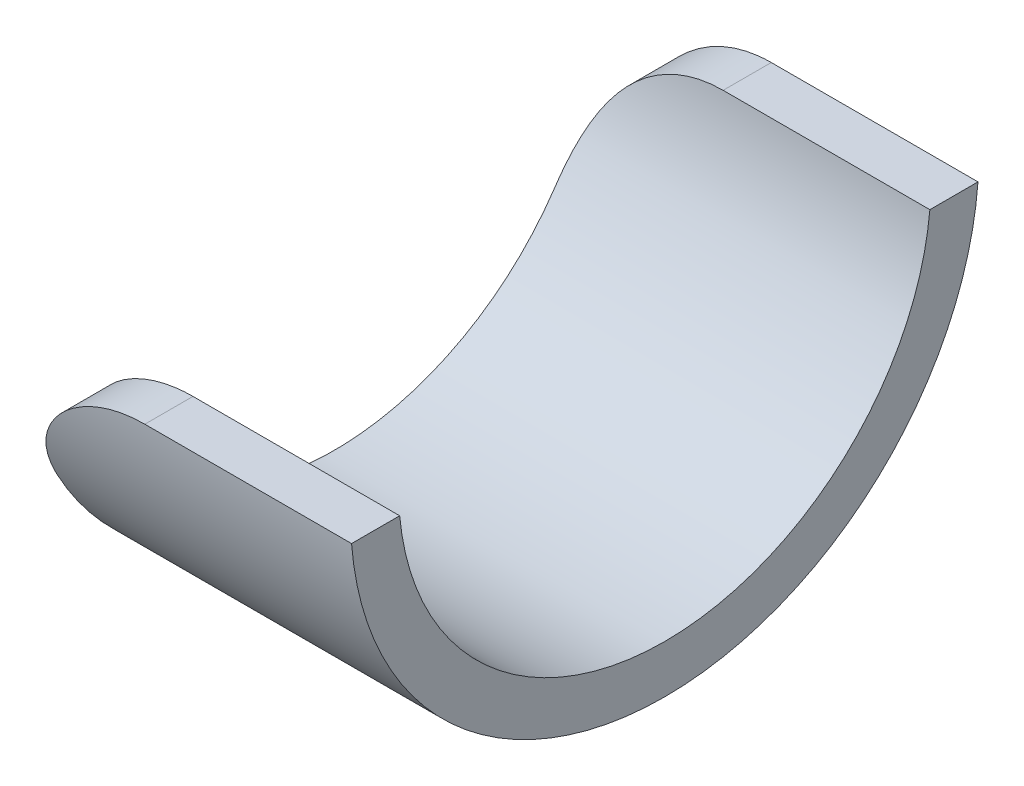
ISO-10303-21;
HEADER;
FILE_DESCRIPTION(('STEP AP214'),'2;1');
FILE_NAME('part.step','',(''),(''),'','','');
FILE_SCHEMA(('AUTOMOTIVE_DESIGN { 1 0 10303 214 1 1 1 1 }'));
ENDSEC;
DATA;
#1=APPLICATION_CONTEXT('core data for automotive mechanical design processes');
#2=APPLICATION_PROTOCOL_DEFINITION('international standard','automotive_design',2000,#1);
#3=PRODUCT_CONTEXT('',#1,'mechanical');
#4=PRODUCT('Part','Part','',(#3));
#5=PRODUCT_RELATED_PRODUCT_CATEGORY('part','',(#4));
#6=PRODUCT_DEFINITION_FORMATION('','',#4);
#7=PRODUCT_DEFINITION_CONTEXT('part definition',#1,'design');
#8=PRODUCT_DEFINITION('design','',#6,#7);
#9=PRODUCT_DEFINITION_SHAPE('','',#8);
#10=(LENGTH_UNIT() NAMED_UNIT(*) SI_UNIT(.MILLI.,.METRE.));
#11=(NAMED_UNIT(*) PLANE_ANGLE_UNIT() SI_UNIT($,.RADIAN.));
#12=(NAMED_UNIT(*) SI_UNIT($,.STERADIAN.) SOLID_ANGLE_UNIT());
#13=UNCERTAINTY_MEASURE_WITH_UNIT(LENGTH_MEASURE(1.E-05),#10,'distance_accuracy_value','');
#14=(GEOMETRIC_REPRESENTATION_CONTEXT(3) GLOBAL_UNCERTAINTY_ASSIGNED_CONTEXT((#13)) GLOBAL_UNIT_ASSIGNED_CONTEXT((#10,
#11,#12)) REPRESENTATION_CONTEXT('',''));
#15=CARTESIAN_POINT('',(0.,0.,0.));
#16=DIRECTION('',(0.,0.,1.));
#17=DIRECTION('',(1.,0.,0.));
#18=AXIS2_PLACEMENT_3D('',#15,#16,#17);
#19=CARTESIAN_POINT('',(25.4,0.,0.));
#20=DIRECTION('',(-1.,0.,0.));
#21=DIRECTION('',(0.,0.,1.));
#22=AXIS2_PLACEMENT_3D('',#19,#20,#21);
#23=CYLINDRICAL_SURFACE('',#22,24.13);
#24=CARTESIAN_POINT('',(0.,0.,0.));
#25=DIRECTION('',(1.,0.,0.));
#26=DIRECTION('',(0.,0.,-1.));
#27=AXIS2_PLACEMENT_3D('',#24,#25,#26);
#28=CIRCLE('',#27,24.13);
#29=CARTESIAN_POINT('',(0.,-11.43,21.2511646739655));
#30=VERTEX_POINT('',#29);
#31=CARTESIAN_POINT('',(0.,-11.43,-21.2511646739655));
#32=VERTEX_POINT('',#31);
#33=EDGE_CURVE('E168',#30,#32,#28,.T.);
#34=ORIENTED_EDGE('',*,*,#33,.T.);
#35=CARTESIAN_POINT('',(0.,-11.43,-21.2511646739655));
#36=CARTESIAN_POINT('',(-2.62243007126413E-05,-11.1860224640543,-21.3824335393108));
#37=CARTESIAN_POINT('',(0.00937477308694025,-10.9396845502003,-21.5094658719944));
#38=CARTESIAN_POINT('',(0.0479236395877504,-10.4439055163118,-21.7544876609394));
#39=CARTESIAN_POINT('',(0.0770830725086785,-10.1944626630503,-21.8724717766096));
#40=CARTESIAN_POINT('',(0.156118837118842,-9.69390311880306,-22.0988883031836));
#41=CARTESIAN_POINT('',(0.206034677985443,-9.44278413916173,-22.2073020174487));
#42=CARTESIAN_POINT('',(0.327202368802155,-8.94150477192952,-22.4138311063666));
#43=CARTESIAN_POINT('',(0.398449861662112,-8.69134419913753,-22.5119485785534));
#44=CARTESIAN_POINT('',(0.562964102877934,-8.19324315777415,-22.6979873973509));
#45=CARTESIAN_POINT('',(0.656316560719896,-7.94531533145705,-22.7858670176028));
#46=CARTESIAN_POINT('',(0.864917743170024,-7.45513554205446,-22.9509202864259));
#47=CARTESIAN_POINT('',(0.980168085088761,-7.21288399968737,-23.0280931434996));
#48=CARTESIAN_POINT('',(1.23201910546764,-6.73697795539725,-23.1717872843801));
#49=CARTESIAN_POINT('',(1.36858542185224,-6.50331035205277,-23.238325368346));
#50=CARTESIAN_POINT('',(1.66250238886438,-6.04664831564512,-23.3613112980713));
#51=CARTESIAN_POINT('',(1.81985155894157,-5.82365312382992,-23.4177598619249));
#52=CARTESIAN_POINT('',(2.14347109553134,-5.40470991060296,-23.5178520749754));
#53=CARTESIAN_POINT('',(2.3085037041298,-5.20794553211169,-23.562088255933));
#54=CARTESIAN_POINT('',(2.65479050631666,-4.82757709066209,-23.6429526368408));
#55=CARTESIAN_POINT('',(2.83604409448118,-4.64397253699317,-23.6795811205675));
#56=CARTESIAN_POINT('',(3.21363852043108,-4.29143598197451,-23.7460034791518));
#57=CARTESIAN_POINT('',(3.40998739998141,-4.12251190492314,-23.7757936768714));
#58=CARTESIAN_POINT('',(3.81630838261891,-3.80087139049984,-23.8293278664702));
#59=CARTESIAN_POINT('',(4.02628051460483,-3.64815498751076,-23.8530718455232));
#60=CARTESIAN_POINT('',(4.45704285565434,-3.36104542848596,-23.895213047223));
#61=CARTESIAN_POINT('',(4.67775947309696,-3.22654644377813,-23.9136419215247));
#62=CARTESIAN_POINT('',(5.12964311440567,-2.97581587645182,-23.9461355713094));
#63=CARTESIAN_POINT('',(5.36081023917931,-2.85958447026916,-23.960200304643));
#64=CARTESIAN_POINT('',(5.831928095831,-2.64628232956131,-23.9846954693647));
#65=CARTESIAN_POINT('',(6.07187653555342,-2.54920663658397,-23.9951268417838));
#66=CARTESIAN_POINT('',(6.55895637291033,-2.37488541721316,-24.0130070257699));
#67=CARTESIAN_POINT('',(6.80608684064031,-2.29763733623003,-24.0204562216298));
#68=CARTESIAN_POINT('',(7.25703859547032,-2.17660389124137,-24.0316919659944));
#69=CARTESIAN_POINT('',(7.45989511606065,-2.12922984902613,-24.0359096588211));
#70=CARTESIAN_POINT('',(7.86827969905803,-2.04787644322711,-24.0429774229925));
#71=CARTESIAN_POINT('',(8.07380739515986,-2.0138952626542,-24.0458276798666));
#72=CARTESIAN_POINT('',(8.48648285909893,-1.95949981658252,-24.0503232209338));
#73=CARTESIAN_POINT('',(8.69362909932989,-1.93907402968682,-24.0519695285443));
#74=CARTESIAN_POINT('',(9.10884950593469,-1.9118178800914,-24.0541447550348));
#75=CARTESIAN_POINT('',(9.31692380045259,-1.90498945704754,-24.0546735144979));
#76=CARTESIAN_POINT('',(9.525,-1.905,-24.0546850945923));
#77=B_SPLINE_CURVE_WITH_KNOTS('',3,(#35,#36,#37,#38,#39,#40,#41,#42,#43,#44,#45,#46,#47,#48,#49,
#50,#51,#52,#53,#54,#55,#56,#57,#58,#59,#60,#61,#62,#63,#64,#65,#66,#67,#68,#69,#70,#71,#72,#73,
#74,#75,#76),.UNSPECIFIED.,.F.,.F.,(4,2,2,2,2,2,2,2,2,2,2,2,2,2,2,2,2,2,2,2,4),(0.,
0.831053790770307,1.66259438406464,2.49572508742816,3.32868573588827,4.16493056434458,
5.0012371793046,5.83620930417523,6.67112197849129,7.45196225401338,8.23277339798149,
9.01400342752858,9.79523511433871,10.5717136526312,11.3481996900133,12.1244844697337,
12.9006691826562,13.5253091224103,14.1498642890198,14.7738879332271,15.3980005876607),.UNSPECIFIED.);
#78=CARTESIAN_POINT('',(9.525,-1.905,-24.0546850945923));
#79=VERTEX_POINT('',#78);
#80=EDGE_CURVE('E46',#32,#79,#77,.T.);
#81=ORIENTED_EDGE('',*,*,#80,.T.);
#82=DIRECTION('',(-1.,0.,0.));
#83=VECTOR('',#82,1.);
#84=CARTESIAN_POINT('',(25.4,-1.905,-24.0546850945923));
#85=LINE('',#84,#83);
#86=CARTESIAN_POINT('',(25.4,-1.905,-24.0546850945923));
#87=VERTEX_POINT('',#86);
#88=EDGE_CURVE('E98',#87,#79,#85,.T.);
#89=ORIENTED_EDGE('',*,*,#88,.F.);
#90=CARTESIAN_POINT('',(25.4,0.,0.));
#91=DIRECTION('',(1.,0.,0.));
#92=DIRECTION('',(0.,0.,-1.));
#93=AXIS2_PLACEMENT_3D('',#90,#91,#92);
#94=CIRCLE('',#93,24.13);
#95=CARTESIAN_POINT('',(25.4,-1.905,24.0546850945923));
#96=VERTEX_POINT('',#95);
#97=EDGE_CURVE('E105',#96,#87,#94,.T.);
#98=ORIENTED_EDGE('',*,*,#97,.F.);
#99=DIRECTION('',(-1.,0.,0.));
#100=VECTOR('',#99,1.);
#101=CARTESIAN_POINT('',(25.4,-1.905,24.0546850945923));
#102=LINE('',#101,#100);
#103=CARTESIAN_POINT('',(9.525,-1.905,24.0546850945923));
#104=VERTEX_POINT('',#103);
#105=EDGE_CURVE('E187',#96,#104,#102,.T.);
#106=ORIENTED_EDGE('',*,*,#105,.T.);
#107=CARTESIAN_POINT('',(9.525,-1.905,24.0546850945923));
#108=CARTESIAN_POINT('',(9.25902855860662,-1.90497112249098,24.0546543706783));
#109=CARTESIAN_POINT('',(8.99305996792605,-1.91613908815105,24.0538018907344));
#110=CARTESIAN_POINT('',(8.46300387273561,-1.9606612994031,24.0502314004206));
#111=CARTESIAN_POINT('',(8.1989163303127,-1.99401509654734,24.0475134277582));
#112=CARTESIAN_POINT('',(7.67456650786336,-2.08268810274374,24.0399910936523));
#113=CARTESIAN_POINT('',(7.41430308962371,-2.1380006327919,24.0351873665735));
#114=CARTESIAN_POINT('',(6.89937138401652,-2.2701777631287,24.0230644040504));
#115=CARTESIAN_POINT('',(6.6447029998715,-2.34704199031998,24.0157452121526));
#116=CARTESIAN_POINT('',(6.14260206552165,-2.52181707329971,23.9980216823762));
#117=CARTESIAN_POINT('',(5.89517469334633,-2.61974259140439,23.9876151932781));
#118=CARTESIAN_POINT('',(5.40953230749561,-2.83586324053376,23.9630257307452));
#119=CARTESIAN_POINT('',(5.17131717562001,-2.9540581113811,23.9488428057835));
#120=CARTESIAN_POINT('',(4.70588661033124,-3.20976539159897,23.9159133288637));
#121=CARTESIAN_POINT('',(4.47866874681592,-3.34727350681213,23.8971677906916));
#122=CARTESIAN_POINT('',(4.03685190596719,-3.64051036300694,23.8542560267361));
#123=CARTESIAN_POINT('',(3.82225273297257,-3.79623882135804,23.8300898850306));
#124=CARTESIAN_POINT('',(3.40913310360506,-4.12311644738061,23.7757019327644));
#125=CARTESIAN_POINT('',(3.21048485846543,-4.29411352349554,23.7455368268045));
#126=CARTESIAN_POINT('',(2.82856447170116,-4.65123007876344,23.6781748356056));
#127=CARTESIAN_POINT('',(2.64529225956836,-4.8373494885639,23.6409779826139));
#128=CARTESIAN_POINT('',(2.29548581756171,-5.22294907941939,23.5587888909164));
#129=CARTESIAN_POINT('',(2.12894399446347,-5.42242313023072,23.5138002140805));
#130=CARTESIAN_POINT('',(1.81359856584554,-5.83295582002549,23.4153383321293));
#131=CARTESIAN_POINT('',(1.6647945124326,-6.04401416629933,23.3618653413296));
#132=CARTESIAN_POINT('',(1.38874855215797,-6.47113711214399,23.2471317644862));
#133=CARTESIAN_POINT('',(1.26111596507832,-6.68700031712436,23.1860605993367));
#134=CARTESIAN_POINT('',(1.02423098390503,-7.12596104699,23.0549352631465));
#135=CARTESIAN_POINT('',(0.914978750332491,-7.34905863503499,22.9848810136632));
#136=CARTESIAN_POINT('',(0.715071957252479,-7.80069709441672,22.8355565811858));
#137=CARTESIAN_POINT('',(0.624434549431874,-8.02924277118396,22.7562780033086));
#138=CARTESIAN_POINT('',(0.461930113313286,-8.48959759740636,22.5885730040502));
#139=CARTESIAN_POINT('',(0.390061506300686,-8.72140647065202,22.5001473529379));
#140=CARTESIAN_POINT('',(0.271603413772416,-9.16141574281794,22.3243212812767));
#141=CARTESIAN_POINT('',(0.223127464472969,-9.36947657204716,22.2378315842086));
#142=CARTESIAN_POINT('',(0.140643449883782,-9.7854805725289,22.0579381550127));
#143=CARTESIAN_POINT('',(0.106635777848727,-9.99342374042991,21.9645342350342));
#144=CARTESIAN_POINT('',(0.0527401220690146,-10.4075477143405,21.771354509249));
#145=CARTESIAN_POINT('',(0.0328187663108996,-10.6137315346706,21.6715943779708));
#146=CARTESIAN_POINT('',(0.00644491721495352,-11.0238100019182,21.4659113001518));
#147=CARTESIAN_POINT('',(-1.12453408408947E-05,-11.2277052573949,21.3599900405856));
#148=CARTESIAN_POINT('',(0.,-11.43,21.2511646739655));
#149=B_SPLINE_CURVE_WITH_KNOTS('',3,(#107,#108,#109,#110,#111,#112,#113,#114,#115,#116,#117,
#118,#119,#120,#121,#122,#123,#124,#125,#126,#127,#128,#129,#130,#131,#132,#133,#134,#135,#136,
#137,#138,#139,#140,#141,#142,#143,#144,#145,#146,#147,#148),.UNSPECIFIED.,.F.,.F.,(4,2,2,2,2,2,
2,2,2,2,2,2,2,2,2,2,2,2,2,2,4),(0.,0.797674807200183,1.59533349129078,2.39274974387176,
3.19015219264293,3.98811157936095,4.78606072424157,5.58383273105668,6.38159236462163,
7.17214191497642,7.96268783999794,8.75287333268876,9.54303886831846,10.316430031771,
11.0898279491281,11.8639353089751,12.6379775347455,13.3288503903548,14.0197420230188,
14.7089913240004,15.3980527824104),.UNSPECIFIED.);
#150=EDGE_CURVE('E53',#104,#30,#149,.T.);
#151=ORIENTED_EDGE('',*,*,#150,.T.);
#152=EDGE_LOOP('',(#34,#81,#89,#98,#106,#151));
#153=FACE_BOUND('',#152,.T.);
#154=ADVANCED_FACE('F37',(#153),#23,.T.);
#155=CARTESIAN_POINT('',(25.4,-1.905,-20.3580643480661));
#156=DIRECTION('',(0.,-1.,0.));
#157=DIRECTION('',(0.,0.,-1.));
#158=AXIS2_PLACEMENT_3D('',#155,#156,#157);
#159=PLANE('',#158);
#160=ORIENTED_EDGE('',*,*,#88,.T.);
#161=DIRECTION('',(0.,0.,1.));
#162=VECTOR('',#161,1.);
#163=CARTESIAN_POINT('',(9.525,-1.905,-20.3580643480661));
#164=LINE('',#163,#162);
#165=CARTESIAN_POINT('',(9.525,-1.905,-20.3580643480661));
#166=VERTEX_POINT('',#165);
#167=EDGE_CURVE('E117',#79,#166,#164,.T.);
#168=ORIENTED_EDGE('',*,*,#167,.T.);
#169=DIRECTION('',(-1.,0.,0.));
#170=VECTOR('',#169,1.);
#171=CARTESIAN_POINT('',(25.4,-1.905,-20.3580643480661));
#172=LINE('',#171,#170);
#173=CARTESIAN_POINT('',(25.4,-1.905,-20.3580643480661));
#174=VERTEX_POINT('',#173);
#175=EDGE_CURVE('E101',#174,#166,#172,.T.);
#176=ORIENTED_EDGE('',*,*,#175,.F.);
#177=DIRECTION('',(0.,0.,1.));
#178=VECTOR('',#177,1.);
#179=CARTESIAN_POINT('',(25.4,-1.905,-20.3580643480661));
#180=LINE('',#179,#178);
#181=EDGE_CURVE('E93',#87,#174,#180,.T.);
#182=ORIENTED_EDGE('',*,*,#181,.F.);
#183=EDGE_LOOP('',(#160,#168,#176,#182));
#184=FACE_BOUND('',#183,.T.);
#185=ADVANCED_FACE('F95',(#184),#159,.F.);
#186=CARTESIAN_POINT('',(25.4,0.,0.));
#187=DIRECTION('',(-1.,0.,0.));
#188=DIRECTION('',(0.,0.,1.));
#189=AXIS2_PLACEMENT_3D('',#186,#187,#188);
#190=CYLINDRICAL_SURFACE('',#189,20.447);
#191=ORIENTED_EDGE('',*,*,#175,.T.);
#192=CARTESIAN_POINT('',(9.525,-1.905,-20.3580643480661));
#193=CARTESIAN_POINT('',(9.25978977014526,-1.90497110377044,-20.3580283743182));
#194=CARTESIAN_POINT('',(8.99458190205295,-1.91607541741178,-20.3570267347558));
#195=CARTESIAN_POINT('',(8.46603330595991,-1.96034336128463,-20.352832188804));
#196=CARTESIAN_POINT('',(8.20269256023756,-1.99350678186011,-20.3496393032408));
#197=CARTESIAN_POINT('',(7.67976710818044,-2.08168051639916,-20.3408028731761));
#198=CARTESIAN_POINT('',(7.42018195184562,-2.13668819010333,-20.3351596248361));
#199=CARTESIAN_POINT('',(6.9065823565463,-2.26813517562933,-20.3209194671558));
#200=CARTESIAN_POINT('',(6.65256781040154,-2.34457407471702,-20.312322614697));
#201=CARTESIAN_POINT('',(6.15172905872527,-2.51837915517059,-20.2915062917797));
#202=CARTESIAN_POINT('',(5.90491062304745,-2.61576163208616,-20.2792839976529));
#203=CARTESIAN_POINT('',(5.42046974204375,-2.83065885374987,-20.2504056126832));
#204=CARTESIAN_POINT('',(5.18284713201861,-2.94817323772638,-20.2337496012912));
#205=CARTESIAN_POINT('',(4.71860313323052,-3.20235227155138,-20.1950801117434));
#206=CARTESIAN_POINT('',(4.49197903223694,-3.33901216747872,-20.1730679625452));
#207=CARTESIAN_POINT('',(4.05136405145136,-3.63034088398203,-20.1226806227278));
#208=CARTESIAN_POINT('',(3.83737292244127,-3.78500934911329,-20.0943055576867));
#209=CARTESIAN_POINT('',(3.42620891630364,-4.10893379759801,-20.030560824482));
#210=CARTESIAN_POINT('',(3.22885954487623,-4.27798374878302,-19.9952828225731));
#211=CARTESIAN_POINT('',(2.84947281277147,-4.63073177356297,-19.9165452957226));
#212=CARTESIAN_POINT('',(2.66743532964771,-4.81442972999756,-19.8730858362156));
#213=CARTESIAN_POINT('',(2.32005992918782,-5.19456017598146,-19.7771267369428));
#214=CARTESIAN_POINT('',(2.15471065709082,-5.39098385541035,-19.724633310632));
#215=CARTESIAN_POINT('',(1.84162833815016,-5.79469430757571,-19.6098279166227));
#216=CARTESIAN_POINT('',(1.69389475833076,-6.00198075137795,-19.5475162461149));
#217=CARTESIAN_POINT('',(1.42089667288137,-6.41906899364777,-19.4144755131979));
#218=CARTESIAN_POINT('',(1.29510049382968,-6.62861897179975,-19.3440467118341));
#219=CARTESIAN_POINT('',(1.06130049022161,-7.05389488573657,-19.1930529525103));
#220=CARTESIAN_POINT('',(0.953296570547871,-7.26962078849771,-19.112488048742));
#221=CARTESIAN_POINT('',(0.755103699314461,-7.70549373801177,-18.9409635820805));
#222=CARTESIAN_POINT('',(0.664940401084745,-7.92564665685008,-18.8499893436497));
#223=CARTESIAN_POINT('',(0.50249570259122,-8.36804475355946,-18.6578079286869));
#224=CARTESIAN_POINT('',(0.430213517538051,-8.59028983916225,-18.5566012015262));
#225=CARTESIAN_POINT('',(0.303153739250019,-9.03487826701944,-18.3442481822495));
#226=CARTESIAN_POINT('',(0.248367946006984,-9.25722151419619,-18.23310657765));
#227=CARTESIAN_POINT('',(0.155607328845854,-9.70043791104361,-18.0012194838147));
#228=CARTESIAN_POINT('',(0.117635672778708,-9.92131077597413,-17.8804721898794));
#229=CARTESIAN_POINT('',(0.057778548534097,-10.3594428106769,-17.6302342348168));
#230=CARTESIAN_POINT('',(0.0358505781251143,-10.5767100272518,-17.5007676745597));
#231=CARTESIAN_POINT('',(0.00695864841239081,-11.0068892110165,-17.2334730625406));
#232=CARTESIAN_POINT('',(-1.40946185446643E-05,-11.2198036619075,-17.0956499678064));
#233=CARTESIAN_POINT('',(0.,-11.43,-16.9539054202859));
#234=B_SPLINE_CURVE_WITH_KNOTS('',3,(#192,#193,#194,#195,#196,#197,#198,#199,#200,#201,#202,
#203,#204,#205,#206,#207,#208,#209,#210,#211,#212,#213,#214,#215,#216,#217,#218,#219,#220,#221,
#222,#223,#224,#225,#226,#227,#228,#229,#230,#231,#232,#233),.UNSPECIFIED.,.F.,.F.,(4,2,2,2,2,2,
2,2,2,2,2,2,2,2,2,2,2,2,2,2,4),(0.,0.795393423654686,1.59077928777243,2.38606904486716,
3.18134348689319,3.97723896055609,4.77312017295292,5.5688041133931,6.3644723516572,
7.15021538340832,7.93595213111672,8.72115060258975,9.5063253112738,10.2684854549721,
11.0306415240326,11.7938856708571,12.5570963134924,13.319948736603,14.082944823085,
14.8439122217054,15.604432555074),.UNSPECIFIED.);
#235=CARTESIAN_POINT('',(0.,-11.43,-16.9539054202859));
#236=VERTEX_POINT('',#235);
#237=EDGE_CURVE('E131',#166,#236,#234,.T.);
#238=ORIENTED_EDGE('',*,*,#237,.T.);
#239=CARTESIAN_POINT('',(0.,0.,0.));
#240=DIRECTION('',(-1.,0.,0.));
#241=DIRECTION('',(0.,0.,-1.));
#242=AXIS2_PLACEMENT_3D('',#239,#240,#241);
#243=CIRCLE('',#242,20.447);
#244=CARTESIAN_POINT('',(0.,-11.43,16.9539054202859));
#245=VERTEX_POINT('',#244);
#246=EDGE_CURVE('E114',#236,#245,#243,.T.);
#247=ORIENTED_EDGE('',*,*,#246,.T.);
#248=CARTESIAN_POINT('',(0.,-11.43,16.9539054202859));
#249=CARTESIAN_POINT('',(-2.26556267190623E-05,-11.1970109347333,17.1110348965797));
#250=CARTESIAN_POINT('',(0.00854996527283876,-10.9606584924522,17.2633409521735));
#251=CARTESIAN_POINT('',(0.0441943253259937,-10.4827345096676,17.557631634213));
#252=CARTESIAN_POINT('',(0.0712805745076498,-10.241159019522,17.6996080681937));
#253=CARTESIAN_POINT('',(0.145377805371788,-9.75392492005596,17.9727321356884));
#254=CARTESIAN_POINT('',(0.192449364536353,-9.50825609668595,18.1038453856936));
#255=CARTESIAN_POINT('',(0.307566450309029,-9.01577956315671,18.3540664977231));
#256=CARTESIAN_POINT('',(0.375606449191654,-8.76897217001962,18.4731775128226));
#257=CARTESIAN_POINT('',(0.53383245903843,-8.27531248509759,18.6995490297245));
#258=CARTESIAN_POINT('',(0.624131647136172,-8.02846661678016,18.8067447749873));
#259=CARTESIAN_POINT('',(0.827078092665168,-7.53872313086899,19.0083559040058));
#260=CARTESIAN_POINT('',(0.939727382262767,-7.29582587447428,19.1027701242966));
#261=CARTESIAN_POINT('',(1.18702756275254,-6.81738744881128,19.2786895398164));
#262=CARTESIAN_POINT('',(1.32162936657595,-6.58183123312698,19.3602227547461));
#263=CARTESIAN_POINT('',(1.61248686004771,-6.12037421258529,19.5110161349573));
#264=CARTESIAN_POINT('',(1.76874040418349,-5.89447245394763,19.580277514731));
#265=CARTESIAN_POINT('',(2.08719310004087,-5.47451213954638,19.7015990829017));
#266=CARTESIAN_POINT('',(2.24764088450731,-5.27940511020473,19.7546393047696));
#267=CARTESIAN_POINT('',(2.58476100175011,-4.90138340496377,19.8518094278578));
#268=CARTESIAN_POINT('',(2.76143244282964,-4.71846805992848,19.8959398183609));
#269=CARTESIAN_POINT('',(3.12994468473486,-4.36644050139834,19.976151579886));
#270=CARTESIAN_POINT('',(3.32179551996768,-4.19733757130689,20.0122275652699));
#271=CARTESIAN_POINT('',(3.7192248194697,-3.87459604014138,20.0772114901172));
#272=CARTESIAN_POINT('',(3.92480339005321,-3.72095755885468,20.1061193740592));
#273=CARTESIAN_POINT('',(4.34587685286661,-3.43207667548693,20.1574291495039));
#274=CARTESIAN_POINT('',(4.56123652101523,-3.29664918935762,20.1798996243166));
#275=CARTESIAN_POINT('',(5.00256224098035,-3.04322714023593,20.2196697315629));
#276=CARTESIAN_POINT('',(5.22853303698627,-2.92524047465008,20.2369670251252));
#277=CARTESIAN_POINT('',(5.68939336395446,-2.7076913191788,20.2672218373143));
#278=CARTESIAN_POINT('',(5.92428109734117,-2.6081251394077,20.2801802255078));
#279=CARTESIAN_POINT('',(6.40133118829256,-2.42815162760385,20.3025150068543));
#280=CARTESIAN_POINT('',(6.64349011485936,-2.34773541457401,20.3118930616464));
#281=CARTESIAN_POINT('',(7.10242990400114,-2.21553591633533,20.3267077281063));
#282=CARTESIAN_POINT('',(7.31852976669072,-2.16141368417318,20.3324935680789));
#283=CARTESIAN_POINT('',(7.75401731871972,-2.06843955546321,20.3421616557291));
#284=CARTESIAN_POINT('',(7.97340471224863,-2.02958629348418,20.3460440736285));
#285=CARTESIAN_POINT('',(8.41426514810789,-1.96736786921801,20.352157279265));
#286=CARTESIAN_POINT('',(8.63573700720965,-1.94399440122065,20.3543889527872));
#287=CARTESIAN_POINT('',(9.0798052484316,-1.91280264393239,20.3573335916408));
#288=CARTESIAN_POINT('',(9.30240173911299,-1.9049858862538,20.358046407436));
#289=CARTESIAN_POINT('',(9.525,-1.905,20.3580643480661));
#290=B_SPLINE_CURVE_WITH_KNOTS('',3,(#248,#249,#250,#251,#252,#253,#254,#255,#256,#257,#258,
#259,#260,#261,#262,#263,#264,#265,#266,#267,#268,#269,#270,#271,#272,#273,#274,#275,#276,#277,
#278,#279,#280,#281,#282,#283,#284,#285,#286,#287,#288,#289),.UNSPECIFIED.,.F.,.F.,(4,2,2,2,2,2,
2,2,2,2,2,2,2,2,2,2,2,2,2,2,4),(0.,0.843012231859918,1.68668593203055,2.53293535688566,
3.37896188300092,4.22938213047316,5.07987973723859,5.92850102018458,6.77703827167067,
7.55044553476625,8.32381031468301,9.09769067222045,9.87157702376157,10.6368826673749,
11.4025337956783,12.1680313867012,12.9331732758271,13.6011795842373,14.2691261424273,
14.9367140217581,15.6043676241904),.UNSPECIFIED.);
#291=CARTESIAN_POINT('',(9.525,-1.905,20.3580643480661));
#292=VERTEX_POINT('',#291);
#293=EDGE_CURVE('E119',#245,#292,#290,.T.);
#294=ORIENTED_EDGE('',*,*,#293,.T.);
#295=DIRECTION('',(-1.,0.,0.));
#296=VECTOR('',#295,1.);
#297=CARTESIAN_POINT('',(25.4,-1.905,20.3580643480661));
#298=LINE('',#297,#296);
#299=CARTESIAN_POINT('',(25.4,-1.905,20.3580643480661));
#300=VERTEX_POINT('',#299);
#301=EDGE_CURVE('E121',#300,#292,#298,.T.);
#302=ORIENTED_EDGE('',*,*,#301,.F.);
#303=CARTESIAN_POINT('',(25.4,0.,0.));
#304=DIRECTION('',(-1.,0.,0.));
#305=DIRECTION('',(0.,0.,-1.));
#306=AXIS2_PLACEMENT_3D('',#303,#304,#305);
#307=CIRCLE('',#306,20.447);
#308=EDGE_CURVE('E104',#174,#300,#307,.T.);
#309=ORIENTED_EDGE('',*,*,#308,.F.);
#310=EDGE_LOOP('',(#191,#238,#247,#294,#302,#309));
#311=FACE_BOUND('',#310,.T.);
#312=ADVANCED_FACE('F137',(#311),#190,.F.);
#313=CARTESIAN_POINT('',(25.4,-1.905,24.0546850945923));
#314=DIRECTION('',(0.,-1.,0.));
#315=DIRECTION('',(0.,0.,-1.));
#316=AXIS2_PLACEMENT_3D('',#313,#314,#315);
#317=PLANE('',#316);
#318=ORIENTED_EDGE('',*,*,#301,.T.);
#319=DIRECTION('',(0.,0.,1.));
#320=VECTOR('',#319,1.);
#321=CARTESIAN_POINT('',(9.525,-1.905,24.0546850945923));
#322=LINE('',#321,#320);
#323=EDGE_CURVE('E11',#292,#104,#322,.T.);
#324=ORIENTED_EDGE('',*,*,#323,.T.);
#325=ORIENTED_EDGE('',*,*,#105,.F.);
#326=DIRECTION('',(0.,0.,1.));
#327=VECTOR('',#326,1.);
#328=CARTESIAN_POINT('',(25.4,-1.905,24.0546850945923));
#329=LINE('',#328,#327);
#330=EDGE_CURVE('E110',#300,#96,#329,.T.);
#331=ORIENTED_EDGE('',*,*,#330,.F.);
#332=EDGE_LOOP('',(#318,#324,#325,#331));
#333=FACE_BOUND('',#332,.T.);
#334=ADVANCED_FACE('F142',(#333),#317,.F.);
#335=CARTESIAN_POINT('',(25.4,0.,0.));
#336=DIRECTION('',(1.,0.,0.));
#337=DIRECTION('',(0.,0.,-1.));
#338=AXIS2_PLACEMENT_3D('',#335,#336,#337);
#339=PLANE('',#338);
#340=ORIENTED_EDGE('',*,*,#97,.T.);
#341=ORIENTED_EDGE('',*,*,#181,.T.);
#342=ORIENTED_EDGE('',*,*,#308,.T.);
#343=ORIENTED_EDGE('',*,*,#330,.T.);
#344=EDGE_LOOP('',(#340,#341,#342,#343));
#345=FACE_BOUND('',#344,.T.);
#346=ADVANCED_FACE('F108',(#345),#339,.T.);
#347=CARTESIAN_POINT('',(0.,0.,0.));
#348=DIRECTION('',(1.,0.,0.));
#349=DIRECTION('',(0.,0.,-1.));
#350=AXIS2_PLACEMENT_3D('',#347,#348,#349);
#351=PLANE('',#350);
#352=ORIENTED_EDGE('',*,*,#246,.F.);
#353=DIRECTION('',(0.,0.,1.));
#354=VECTOR('',#353,1.);
#355=CARTESIAN_POINT('',(0.,-11.43,0.));
#356=LINE('',#355,#354);
#357=EDGE_CURVE('E60',#236,#32,#356,.F.);
#358=ORIENTED_EDGE('',*,*,#357,.T.);
#359=ORIENTED_EDGE('',*,*,#33,.F.);
#360=DIRECTION('',(0.,0.,1.));
#361=VECTOR('',#360,1.);
#362=CARTESIAN_POINT('',(0.,-11.43,0.));
#363=LINE('',#362,#361);
#364=EDGE_CURVE('E163',#30,#245,#363,.F.);
#365=ORIENTED_EDGE('',*,*,#364,.T.);
#366=EDGE_LOOP('',(#352,#358,#359,#365));
#367=FACE_BOUND('',#366,.T.);
#368=ADVANCED_FACE('F167',(#367),#351,.F.);
#369=CARTESIAN_POINT('',(9.525,-11.43,-20.3580643480661));
#370=DIRECTION('',(0.,0.,1.));
#371=DIRECTION('',(1.,0.,0.));
#372=AXIS2_PLACEMENT_3D('',#369,#370,#371);
#373=CYLINDRICAL_SURFACE('',#372,9.525);
#374=ORIENTED_EDGE('',*,*,#80,.F.);
#375=ORIENTED_EDGE('',*,*,#357,.F.);
#376=ORIENTED_EDGE('',*,*,#237,.F.);
#377=ORIENTED_EDGE('',*,*,#167,.F.);
#378=EDGE_LOOP('',(#374,#375,#376,#377));
#379=FACE_BOUND('',#378,.T.);
#380=ADVANCED_FACE('F150',(#379),#373,.T.);
#381=CARTESIAN_POINT('',(9.525,-11.43,24.0546850945923));
#382=DIRECTION('',(0.,0.,1.));
#383=DIRECTION('',(1.,0.,0.));
#384=AXIS2_PLACEMENT_3D('',#381,#382,#383);
#385=CYLINDRICAL_SURFACE('',#384,9.525);
#386=ORIENTED_EDGE('',*,*,#293,.F.);
#387=ORIENTED_EDGE('',*,*,#364,.F.);
#388=ORIENTED_EDGE('',*,*,#150,.F.);
#389=ORIENTED_EDGE('',*,*,#323,.F.);
#390=EDGE_LOOP('',(#386,#387,#388,#389));
#391=FACE_BOUND('',#390,.T.);
#392=ADVANCED_FACE('F39',(#391),#385,.T.);
#393=CLOSED_SHELL('',(#154,#185,#312,#334,#346,#368,#380,#392));
#394=MANIFOLD_SOLID_BREP('B2',#393);
#395=ADVANCED_BREP_SHAPE_REPRESENTATION('',(#18,#394),#14);
#396=SHAPE_DEFINITION_REPRESENTATION(#9,#395);
ENDSEC;
END-ISO-10303-21;
